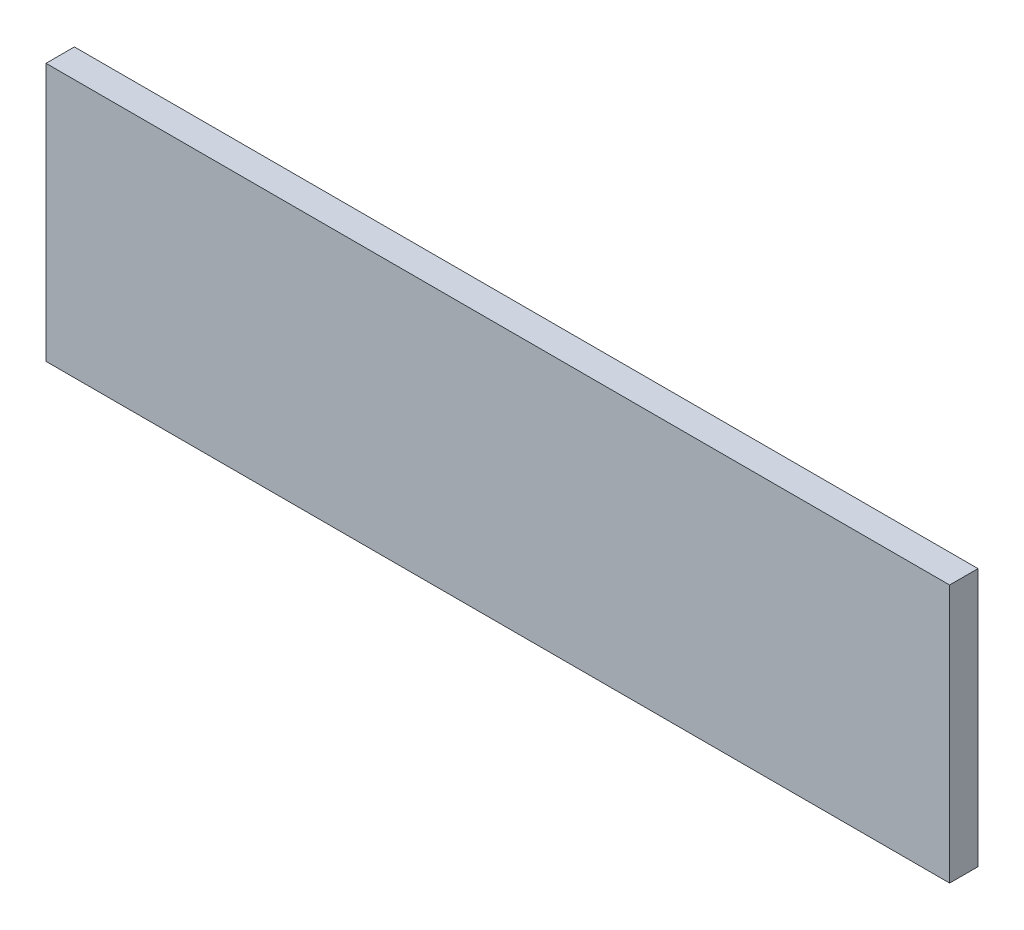
ISO-10303-21;
HEADER;
FILE_DESCRIPTION(('STEP AP214'),'2;1');
FILE_NAME('part.step','',(''),(''),'','','');
FILE_SCHEMA(('AUTOMOTIVE_DESIGN { 1 0 10303 214 1 1 1 1 }'));
ENDSEC;
DATA;
#1=APPLICATION_CONTEXT('core data for automotive mechanical design processes');
#2=APPLICATION_PROTOCOL_DEFINITION('international standard','automotive_design',2000,#1);
#3=PRODUCT_CONTEXT('',#1,'mechanical');
#4=PRODUCT('Part','Part','',(#3));
#5=PRODUCT_RELATED_PRODUCT_CATEGORY('part','',(#4));
#6=PRODUCT_DEFINITION_FORMATION('','',#4);
#7=PRODUCT_DEFINITION_CONTEXT('part definition',#1,'design');
#8=PRODUCT_DEFINITION('design','',#6,#7);
#9=PRODUCT_DEFINITION_SHAPE('','',#8);
#10=(LENGTH_UNIT() NAMED_UNIT(*) SI_UNIT(.MILLI.,.METRE.));
#11=(NAMED_UNIT(*) PLANE_ANGLE_UNIT() SI_UNIT($,.RADIAN.));
#12=(NAMED_UNIT(*) SI_UNIT($,.STERADIAN.) SOLID_ANGLE_UNIT());
#13=UNCERTAINTY_MEASURE_WITH_UNIT(LENGTH_MEASURE(1.E-05),#10,'distance_accuracy_value','');
#14=(GEOMETRIC_REPRESENTATION_CONTEXT(3) GLOBAL_UNCERTAINTY_ASSIGNED_CONTEXT((#13)) GLOBAL_UNIT_ASSIGNED_CONTEXT((#10,
#11,#12)) REPRESENTATION_CONTEXT('',''));
#15=CARTESIAN_POINT('',(0.,0.,0.));
#16=DIRECTION('',(0.,0.,1.));
#17=DIRECTION('',(1.,0.,0.));
#18=AXIS2_PLACEMENT_3D('',#15,#16,#17);
#19=CARTESIAN_POINT('',(-134.4,59.2666666666667,11.));
#20=DIRECTION('',(1.,0.,0.));
#21=DIRECTION('',(0.,1.,0.));
#22=AXIS2_PLACEMENT_3D('',#19,#20,#21);
#23=PLANE('',#22);
#24=DIRECTION('',(0.,-1.,0.));
#25=VECTOR('',#24,1.);
#26=CARTESIAN_POINT('',(-134.4,59.2666666666667,0.));
#27=LINE('',#26,#25);
#28=CARTESIAN_POINT('',(-134.4,59.2666666666667,0.));
#29=VERTEX_POINT('',#28);
#30=CARTESIAN_POINT('',(-134.4,-40.7333333333333,0.));
#31=VERTEX_POINT('',#30);
#32=EDGE_CURVE('E95',#29,#31,#27,.T.);
#33=ORIENTED_EDGE('',*,*,#32,.T.);
#34=DIRECTION('',(0.,0.,-1.));
#35=VECTOR('',#34,1.);
#36=CARTESIAN_POINT('',(-134.4,-40.7333333333333,11.));
#37=LINE('',#36,#35);
#38=CARTESIAN_POINT('',(-134.4,-40.7333333333333,11.));
#39=VERTEX_POINT('',#38);
#40=EDGE_CURVE('E11',#39,#31,#37,.T.);
#41=ORIENTED_EDGE('',*,*,#40,.F.);
#42=DIRECTION('',(0.,-1.,0.));
#43=VECTOR('',#42,1.);
#44=CARTESIAN_POINT('',(-134.4,59.2666666666667,11.));
#45=LINE('',#44,#43);
#46=CARTESIAN_POINT('',(-134.4,59.2666666666667,11.));
#47=VERTEX_POINT('',#46);
#48=EDGE_CURVE('E83',#47,#39,#45,.T.);
#49=ORIENTED_EDGE('',*,*,#48,.F.);
#50=DIRECTION('',(0.,0.,-1.));
#51=VECTOR('',#50,1.);
#52=CARTESIAN_POINT('',(-134.4,59.2666666666667,11.));
#53=LINE('',#52,#51);
#54=EDGE_CURVE('E91',#47,#29,#53,.T.);
#55=ORIENTED_EDGE('',*,*,#54,.T.);
#56=EDGE_LOOP('',(#33,#41,#49,#55));
#57=FACE_BOUND('',#56,.T.);
#58=ADVANCED_FACE('F32',(#57),#23,.F.);
#59=CARTESIAN_POINT('',(-134.4,-40.7333333333333,11.));
#60=DIRECTION('',(0.,1.,0.));
#61=DIRECTION('',(0.,0.,1.));
#62=AXIS2_PLACEMENT_3D('',#59,#60,#61);
#63=PLANE('',#62);
#64=DIRECTION('',(1.,0.,0.));
#65=VECTOR('',#64,1.);
#66=CARTESIAN_POINT('',(-134.4,-40.7333333333333,0.));
#67=LINE('',#66,#65);
#68=CARTESIAN_POINT('',(215.6,-40.7333333333333,0.));
#69=VERTEX_POINT('',#68);
#70=EDGE_CURVE('E87',#31,#69,#67,.T.);
#71=ORIENTED_EDGE('',*,*,#70,.T.);
#72=DIRECTION('',(0.,0.,-1.));
#73=VECTOR('',#72,1.);
#74=CARTESIAN_POINT('',(215.6,-40.7333333333333,11.));
#75=LINE('',#74,#73);
#76=CARTESIAN_POINT('',(215.6,-40.7333333333333,11.));
#77=VERTEX_POINT('',#76);
#78=EDGE_CURVE('E40',#77,#69,#75,.T.);
#79=ORIENTED_EDGE('',*,*,#78,.F.);
#80=DIRECTION('',(1.,0.,0.));
#81=VECTOR('',#80,1.);
#82=CARTESIAN_POINT('',(-134.4,-40.7333333333333,11.));
#83=LINE('',#82,#81);
#84=EDGE_CURVE('E78',#39,#77,#83,.T.);
#85=ORIENTED_EDGE('',*,*,#84,.F.);
#86=ORIENTED_EDGE('',*,*,#40,.T.);
#87=EDGE_LOOP('',(#71,#79,#85,#86));
#88=FACE_BOUND('',#87,.T.);
#89=ADVANCED_FACE('F86',(#88),#63,.F.);
#90=CARTESIAN_POINT('',(215.6,59.2666666666667,11.));
#91=DIRECTION('',(-1.,0.,0.));
#92=DIRECTION('',(0.,0.,1.));
#93=AXIS2_PLACEMENT_3D('',#90,#91,#92);
#94=PLANE('',#93);
#95=DIRECTION('',(0.,1.,0.));
#96=VECTOR('',#95,1.);
#97=CARTESIAN_POINT('',(215.6,59.2666666666667,0.));
#98=LINE('',#97,#96);
#99=CARTESIAN_POINT('',(215.6,59.2666666666667,0.));
#100=VERTEX_POINT('',#99);
#101=EDGE_CURVE('E65',#69,#100,#98,.T.);
#102=ORIENTED_EDGE('',*,*,#101,.T.);
#103=DIRECTION('',(0.,0.,-1.));
#104=VECTOR('',#103,1.);
#105=CARTESIAN_POINT('',(215.6,59.2666666666667,11.));
#106=LINE('',#105,#104);
#107=CARTESIAN_POINT('',(215.6,59.2666666666667,11.));
#108=VERTEX_POINT('',#107);
#109=EDGE_CURVE('E88',#108,#100,#106,.T.);
#110=ORIENTED_EDGE('',*,*,#109,.F.);
#111=DIRECTION('',(0.,1.,0.));
#112=VECTOR('',#111,1.);
#113=CARTESIAN_POINT('',(215.6,59.2666666666667,11.));
#114=LINE('',#113,#112);
#115=EDGE_CURVE('E81',#77,#108,#114,.T.);
#116=ORIENTED_EDGE('',*,*,#115,.F.);
#117=ORIENTED_EDGE('',*,*,#78,.T.);
#118=EDGE_LOOP('',(#102,#110,#116,#117));
#119=FACE_BOUND('',#118,.T.);
#120=ADVANCED_FACE('F89',(#119),#94,.F.);
#121=CARTESIAN_POINT('',(-134.4,59.2666666666667,11.));
#122=DIRECTION('',(0.,-1.,0.));
#123=DIRECTION('',(0.,0.,-1.));
#124=AXIS2_PLACEMENT_3D('',#121,#122,#123);
#125=PLANE('',#124);
#126=DIRECTION('',(-1.,0.,0.));
#127=VECTOR('',#126,1.);
#128=CARTESIAN_POINT('',(-134.4,59.2666666666667,0.));
#129=LINE('',#128,#127);
#130=EDGE_CURVE('E71',#100,#29,#129,.T.);
#131=ORIENTED_EDGE('',*,*,#130,.T.);
#132=ORIENTED_EDGE('',*,*,#54,.F.);
#133=DIRECTION('',(-1.,0.,0.));
#134=VECTOR('',#133,1.);
#135=CARTESIAN_POINT('',(-134.4,59.2666666666667,11.));
#136=LINE('',#135,#134);
#137=EDGE_CURVE('E48',#108,#47,#136,.T.);
#138=ORIENTED_EDGE('',*,*,#137,.F.);
#139=ORIENTED_EDGE('',*,*,#109,.T.);
#140=EDGE_LOOP('',(#131,#132,#138,#139));
#141=FACE_BOUND('',#140,.T.);
#142=ADVANCED_FACE('F102',(#141),#125,.F.);
#143=CARTESIAN_POINT('',(0.,0.,11.));
#144=DIRECTION('',(0.,0.,1.));
#145=DIRECTION('',(1.,0.,0.));
#146=AXIS2_PLACEMENT_3D('',#143,#144,#145);
#147=PLANE('',#146);
#148=ORIENTED_EDGE('',*,*,#48,.T.);
#149=ORIENTED_EDGE('',*,*,#84,.T.);
#150=ORIENTED_EDGE('',*,*,#115,.T.);
#151=ORIENTED_EDGE('',*,*,#137,.T.);
#152=EDGE_LOOP('',(#148,#149,#150,#151));
#153=FACE_BOUND('',#152,.T.);
#154=ADVANCED_FACE('F79',(#153),#147,.T.);
#155=CARTESIAN_POINT('',(0.,0.,0.));
#156=DIRECTION('',(0.,0.,1.));
#157=DIRECTION('',(1.,0.,0.));
#158=AXIS2_PLACEMENT_3D('',#155,#156,#157);
#159=PLANE('',#158);
#160=ORIENTED_EDGE('',*,*,#32,.F.);
#161=ORIENTED_EDGE('',*,*,#130,.F.);
#162=ORIENTED_EDGE('',*,*,#101,.F.);
#163=ORIENTED_EDGE('',*,*,#70,.F.);
#164=EDGE_LOOP('',(#160,#161,#162,#163));
#165=FACE_BOUND('',#164,.T.);
#166=ADVANCED_FACE('F105',(#165),#159,.F.);
#167=CLOSED_SHELL('',(#58,#89,#120,#142,#154,#166));
#168=MANIFOLD_SOLID_BREP('B2',#167);
#169=ADVANCED_BREP_SHAPE_REPRESENTATION('',(#18,#168),#14);
#170=SHAPE_DEFINITION_REPRESENTATION(#9,#169);
ENDSEC;
END-ISO-10303-21;
